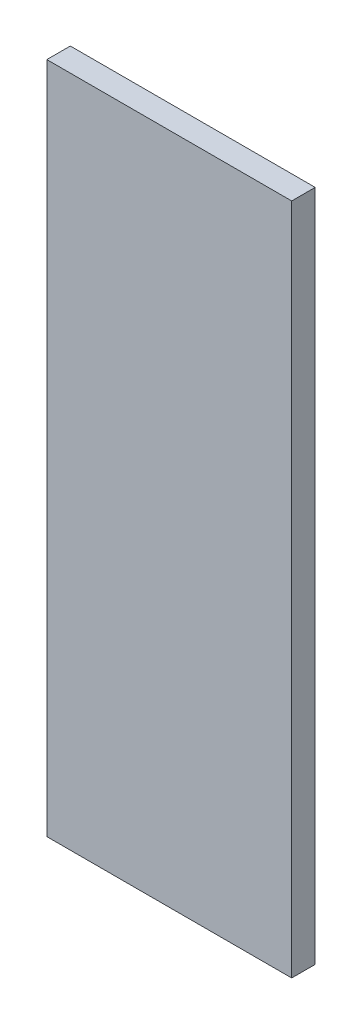
ISO-10303-21;
HEADER;
FILE_DESCRIPTION(('STEP AP214'),'2;1');
FILE_NAME('part.step','',(''),(''),'','','');
FILE_SCHEMA(('AUTOMOTIVE_DESIGN { 1 0 10303 214 1 1 1 1 }'));
ENDSEC;
DATA;
#1=APPLICATION_CONTEXT('core data for automotive mechanical design processes');
#2=APPLICATION_PROTOCOL_DEFINITION('international standard','automotive_design',2000,#1);
#3=PRODUCT_CONTEXT('',#1,'mechanical');
#4=PRODUCT('Part','Part','',(#3));
#5=PRODUCT_RELATED_PRODUCT_CATEGORY('part','',(#4));
#6=PRODUCT_DEFINITION_FORMATION('','',#4);
#7=PRODUCT_DEFINITION_CONTEXT('part definition',#1,'design');
#8=PRODUCT_DEFINITION('design','',#6,#7);
#9=PRODUCT_DEFINITION_SHAPE('','',#8);
#10=(LENGTH_UNIT() NAMED_UNIT(*) SI_UNIT(.MILLI.,.METRE.));
#11=(NAMED_UNIT(*) PLANE_ANGLE_UNIT() SI_UNIT($,.RADIAN.));
#12=(NAMED_UNIT(*) SI_UNIT($,.STERADIAN.) SOLID_ANGLE_UNIT());
#13=UNCERTAINTY_MEASURE_WITH_UNIT(LENGTH_MEASURE(1.E-05),#10,'distance_accuracy_value','');
#14=(GEOMETRIC_REPRESENTATION_CONTEXT(3) GLOBAL_UNCERTAINTY_ASSIGNED_CONTEXT((#13)) GLOBAL_UNIT_ASSIGNED_CONTEXT((#10,
#11,#12)) REPRESENTATION_CONTEXT('',''));
#15=CARTESIAN_POINT('',(0.,0.,0.));
#16=DIRECTION('',(0.,0.,1.));
#17=DIRECTION('',(1.,0.,0.));
#18=AXIS2_PLACEMENT_3D('',#15,#16,#17);
#19=CARTESIAN_POINT('',(1.2400408919979,-0.636643661734989,0.));
#20=DIRECTION('',(0.,1.,0.));
#21=DIRECTION('',(-1.,0.,0.));
#22=AXIS2_PLACEMENT_3D('',#19,#20,#21);
#23=PLANE('',#22);
#24=DIRECTION('',(-1.,0.,0.));
#25=VECTOR('',#24,1.);
#26=CARTESIAN_POINT('',(1.2400408919979,-0.636643661734989,0.));
#27=LINE('',#26,#25);
#28=CARTESIAN_POINT('',(1.2400408919979,-0.636643661734989,0.));
#29=VERTEX_POINT('',#28);
#30=CARTESIAN_POINT('',(1.2087748288676,-0.636643661734989,0.));
#31=VERTEX_POINT('',#30);
#32=EDGE_CURVE('E11',#29,#31,#27,.T.);
#33=ORIENTED_EDGE('',*,*,#32,.T.);
#34=DIRECTION('',(0.,0.,1.));
#35=VECTOR('',#34,1.);
#36=CARTESIAN_POINT('',(1.2087748288676,-0.636643661734989,0.));
#37=LINE('',#36,#35);
#38=CARTESIAN_POINT('',(1.2087748288676,-0.636643661734989,0.003));
#39=VERTEX_POINT('',#38);
#40=EDGE_CURVE('E24',#31,#39,#37,.T.);
#41=ORIENTED_EDGE('',*,*,#40,.T.);
#42=DIRECTION('',(-1.,0.,0.));
#43=VECTOR('',#42,1.);
#44=CARTESIAN_POINT('',(1.2400408919979,-0.636643661734989,0.003));
#45=LINE('',#44,#43);
#46=CARTESIAN_POINT('',(1.2400408919979,-0.636643661734989,0.003));
#47=VERTEX_POINT('',#46);
#48=EDGE_CURVE('E75',#47,#39,#45,.T.);
#49=ORIENTED_EDGE('',*,*,#48,.F.);
#50=DIRECTION('',(0.,0.,1.));
#51=VECTOR('',#50,1.);
#52=CARTESIAN_POINT('',(1.2400408919979,-0.636643661734989,0.));
#53=LINE('',#52,#51);
#54=EDGE_CURVE('E86',#29,#47,#53,.T.);
#55=ORIENTED_EDGE('',*,*,#54,.F.);
#56=EDGE_LOOP('',(#33,#41,#49,#55));
#57=FACE_BOUND('',#56,.T.);
#58=ADVANCED_FACE('F17',(#57),#23,.T.);
#59=CARTESIAN_POINT('',(1.2400408919979,-0.722568280483534,0.));
#60=DIRECTION('',(1.,0.,0.));
#61=DIRECTION('',(0.,1.,0.));
#62=AXIS2_PLACEMENT_3D('',#59,#60,#61);
#63=PLANE('',#62);
#64=DIRECTION('',(0.,1.,0.));
#65=VECTOR('',#64,1.);
#66=CARTESIAN_POINT('',(1.2400408919979,-0.722568280483534,0.));
#67=LINE('',#66,#65);
#68=CARTESIAN_POINT('',(1.2400408919979,-0.722568280483534,0.));
#69=VERTEX_POINT('',#68);
#70=EDGE_CURVE('E83',#69,#29,#67,.T.);
#71=ORIENTED_EDGE('',*,*,#70,.T.);
#72=ORIENTED_EDGE('',*,*,#54,.T.);
#73=DIRECTION('',(0.,1.,0.));
#74=VECTOR('',#73,1.);
#75=CARTESIAN_POINT('',(1.2400408919979,-0.722568280483534,0.003));
#76=LINE('',#75,#74);
#77=CARTESIAN_POINT('',(1.2400408919979,-0.722568280483534,0.003));
#78=VERTEX_POINT('',#77);
#79=EDGE_CURVE('E81',#78,#47,#76,.T.);
#80=ORIENTED_EDGE('',*,*,#79,.F.);
#81=DIRECTION('',(0.,0.,1.));
#82=VECTOR('',#81,1.);
#83=CARTESIAN_POINT('',(1.2400408919979,-0.722568280483534,0.));
#84=LINE('',#83,#82);
#85=EDGE_CURVE('E61',#69,#78,#84,.T.);
#86=ORIENTED_EDGE('',*,*,#85,.F.);
#87=EDGE_LOOP('',(#71,#72,#80,#86));
#88=FACE_BOUND('',#87,.T.);
#89=ADVANCED_FACE('F91',(#88),#63,.T.);
#90=CARTESIAN_POINT('',(1.2087748288676,-0.722568280483534,0.));
#91=DIRECTION('',(0.,-1.,0.));
#92=DIRECTION('',(1.,0.,0.));
#93=AXIS2_PLACEMENT_3D('',#90,#91,#92);
#94=PLANE('',#93);
#95=DIRECTION('',(1.,0.,0.));
#96=VECTOR('',#95,1.);
#97=CARTESIAN_POINT('',(1.2087748288676,-0.722568280483534,0.));
#98=LINE('',#97,#96);
#99=CARTESIAN_POINT('',(1.2087748288676,-0.722568280483534,0.));
#100=VERTEX_POINT('',#99);
#101=EDGE_CURVE('E65',#100,#69,#98,.T.);
#102=ORIENTED_EDGE('',*,*,#101,.T.);
#103=ORIENTED_EDGE('',*,*,#85,.T.);
#104=DIRECTION('',(1.,0.,0.));
#105=VECTOR('',#104,1.);
#106=CARTESIAN_POINT('',(1.2087748288676,-0.722568280483534,0.003));
#107=LINE('',#106,#105);
#108=CARTESIAN_POINT('',(1.2087748288676,-0.722568280483534,0.003));
#109=VERTEX_POINT('',#108);
#110=EDGE_CURVE('E54',#109,#78,#107,.T.);
#111=ORIENTED_EDGE('',*,*,#110,.F.);
#112=DIRECTION('',(0.,0.,1.));
#113=VECTOR('',#112,1.);
#114=CARTESIAN_POINT('',(1.2087748288676,-0.722568280483534,0.));
#115=LINE('',#114,#113);
#116=EDGE_CURVE('E58',#100,#109,#115,.T.);
#117=ORIENTED_EDGE('',*,*,#116,.F.);
#118=EDGE_LOOP('',(#102,#103,#111,#117));
#119=FACE_BOUND('',#118,.T.);
#120=ADVANCED_FACE('F57',(#119),#94,.T.);
#121=CARTESIAN_POINT('',(1.2087748288676,-0.636643661734989,0.));
#122=DIRECTION('',(-1.,0.,0.));
#123=DIRECTION('',(0.,-1.,0.));
#124=AXIS2_PLACEMENT_3D('',#121,#122,#123);
#125=PLANE('',#124);
#126=DIRECTION('',(0.,-1.,0.));
#127=VECTOR('',#126,1.);
#128=CARTESIAN_POINT('',(1.2087748288676,-0.636643661734989,0.));
#129=LINE('',#128,#127);
#130=EDGE_CURVE('E71',#31,#100,#129,.T.);
#131=ORIENTED_EDGE('',*,*,#130,.T.);
#132=ORIENTED_EDGE('',*,*,#116,.T.);
#133=DIRECTION('',(0.,-1.,0.));
#134=VECTOR('',#133,1.);
#135=CARTESIAN_POINT('',(1.2087748288676,-0.636643661734989,0.003));
#136=LINE('',#135,#134);
#137=EDGE_CURVE('E70',#39,#109,#136,.T.);
#138=ORIENTED_EDGE('',*,*,#137,.F.);
#139=ORIENTED_EDGE('',*,*,#40,.F.);
#140=EDGE_LOOP('',(#131,#132,#138,#139));
#141=FACE_BOUND('',#140,.T.);
#142=ADVANCED_FACE('F69',(#141),#125,.T.);
#143=CARTESIAN_POINT('',(1.2244078604327,-0.679605971109262,0.003));
#144=DIRECTION('',(0.,0.,1.));
#145=DIRECTION('',(1.,0.,0.));
#146=AXIS2_PLACEMENT_3D('',#143,#144,#145);
#147=PLANE('',#146);
#148=ORIENTED_EDGE('',*,*,#137,.T.);
#149=ORIENTED_EDGE('',*,*,#110,.T.);
#150=ORIENTED_EDGE('',*,*,#79,.T.);
#151=ORIENTED_EDGE('',*,*,#48,.T.);
#152=EDGE_LOOP('',(#148,#149,#150,#151));
#153=FACE_BOUND('',#152,.T.);
#154=ADVANCED_FACE('F74',(#153),#147,.T.);
#155=CARTESIAN_POINT('',(1.2244078604327,-0.679605971109262,0.));
#156=DIRECTION('',(0.,0.,1.));
#157=DIRECTION('',(1.,0.,0.));
#158=AXIS2_PLACEMENT_3D('',#155,#156,#157);
#159=PLANE('',#158);
#160=ORIENTED_EDGE('',*,*,#130,.F.);
#161=ORIENTED_EDGE('',*,*,#32,.F.);
#162=ORIENTED_EDGE('',*,*,#70,.F.);
#163=ORIENTED_EDGE('',*,*,#101,.F.);
#164=EDGE_LOOP('',(#160,#161,#162,#163));
#165=FACE_BOUND('',#164,.T.);
#166=ADVANCED_FACE('F89',(#165),#159,.F.);
#167=CLOSED_SHELL('',(#58,#89,#120,#142,#154,#166));
#168=MANIFOLD_SOLID_BREP('B1',#167);
#169=ADVANCED_BREP_SHAPE_REPRESENTATION('',(#18,#168),#14);
#170=SHAPE_DEFINITION_REPRESENTATION(#9,#169);
ENDSEC;
END-ISO-10303-21;
